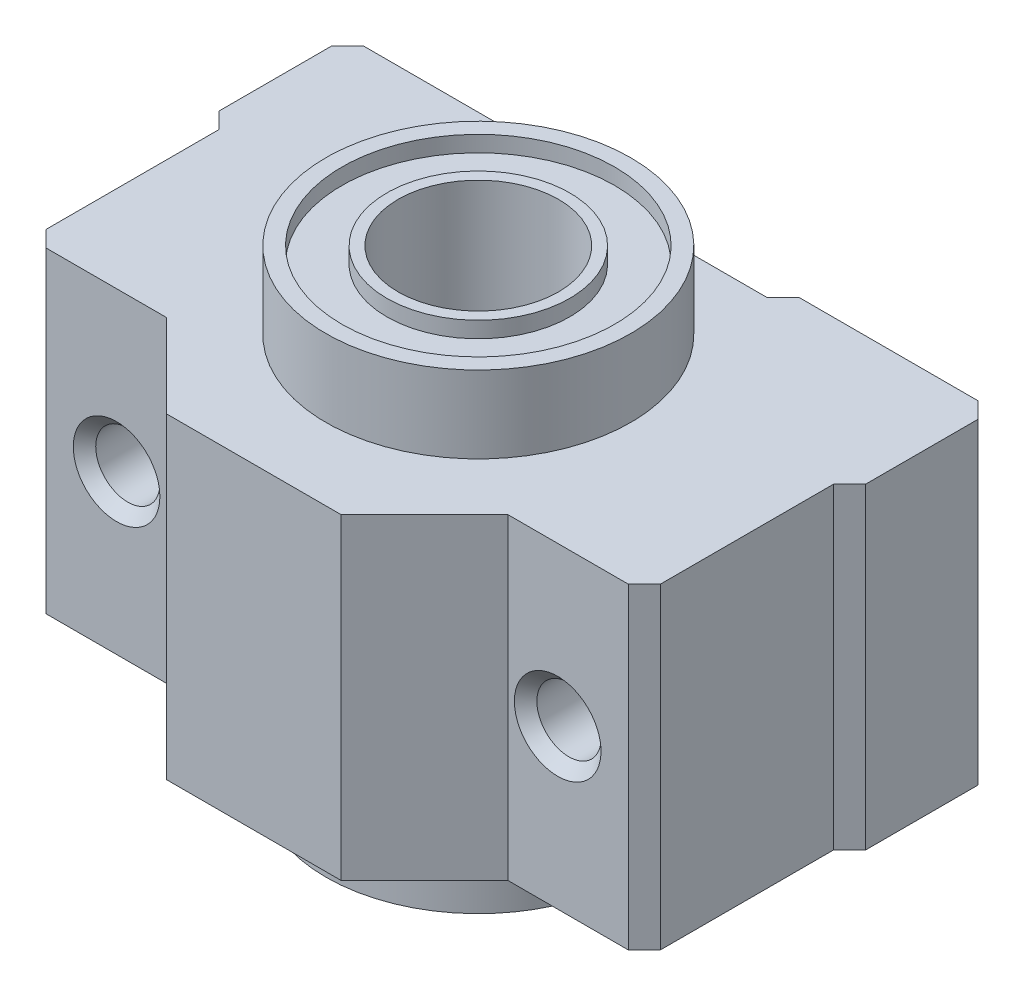
ISO-10303-21;
HEADER;
FILE_DESCRIPTION(('STEP AP214'),'2;1');
FILE_NAME('part.step','',(''),(''),'','','');
FILE_SCHEMA(('AUTOMOTIVE_DESIGN { 1 0 10303 214 1 1 1 1 }'));
ENDSEC;
DATA;
#1=APPLICATION_CONTEXT('core data for automotive mechanical design processes');
#2=APPLICATION_PROTOCOL_DEFINITION('international standard','automotive_design',2000,#1);
#3=PRODUCT_CONTEXT('',#1,'mechanical');
#4=PRODUCT('Part','Part','',(#3));
#5=PRODUCT_RELATED_PRODUCT_CATEGORY('part','',(#4));
#6=PRODUCT_DEFINITION_FORMATION('','',#4);
#7=PRODUCT_DEFINITION_CONTEXT('part definition',#1,'design');
#8=PRODUCT_DEFINITION('design','',#6,#7);
#9=PRODUCT_DEFINITION_SHAPE('','',#8);
#10=(LENGTH_UNIT() NAMED_UNIT(*) SI_UNIT(.MILLI.,.METRE.));
#11=(NAMED_UNIT(*) PLANE_ANGLE_UNIT() SI_UNIT($,.RADIAN.));
#12=(NAMED_UNIT(*) SI_UNIT($,.STERADIAN.) SOLID_ANGLE_UNIT());
#13=UNCERTAINTY_MEASURE_WITH_UNIT(LENGTH_MEASURE(1.E-05),#10,'distance_accuracy_value','');
#14=(GEOMETRIC_REPRESENTATION_CONTEXT(3) GLOBAL_UNCERTAINTY_ASSIGNED_CONTEXT((#13)) GLOBAL_UNIT_ASSIGNED_CONTEXT((#10,
#11,#12)) REPRESENTATION_CONTEXT('',''));
#15=CARTESIAN_POINT('',(0.,0.,0.));
#16=DIRECTION('',(0.,0.,1.));
#17=DIRECTION('',(1.,0.,0.));
#18=AXIS2_PLACEMENT_3D('',#15,#16,#17);
#19=CARTESIAN_POINT('',(1.11022302462516E-13,-14.6750000000002,12.));
#20=DIRECTION('',(0.,-1.,0.));
#21=DIRECTION('',(0.,0.,-1.));
#22=AXIS2_PLACEMENT_3D('',#19,#20,#21);
#23=PLANE('',#22);
#24=CARTESIAN_POINT('',(1.11022302462516E-13,-14.6750000000002,12.));
#25=DIRECTION('',(0.,-1.,0.));
#26=DIRECTION('',(0.,0.,-1.));
#27=AXIS2_PLACEMENT_3D('',#24,#25,#26);
#28=CIRCLE('',#27,5.);
#29=CARTESIAN_POINT('',(1.14214193658313E-13,-14.6750000000002,6.99999999999998));
#30=VERTEX_POINT('',#29);
#31=EDGE_CURVE('E282',#30,#30,#28,.T.);
#32=ORIENTED_EDGE('',*,*,#31,.F.);
#33=EDGE_LOOP('',(#32));
#34=FACE_BOUND('',#33,.T.);
#35=CARTESIAN_POINT('',(1.11022302462516E-13,-14.6750000000002,12.));
#36=DIRECTION('',(0.,1.,0.));
#37=DIRECTION('',(0.,0.,1.));
#38=AXIS2_PLACEMENT_3D('',#35,#36,#37);
#39=CIRCLE('',#38,5.7);
#40=CARTESIAN_POINT('',(1.07383546499307E-13,-14.6750000000002,17.7));
#41=VERTEX_POINT('',#40);
#42=EDGE_CURVE('E436',#41,#41,#39,.T.);
#43=ORIENTED_EDGE('',*,*,#42,.F.);
#44=EDGE_LOOP('',(#43));
#45=FACE_BOUND('',#44,.T.);
#46=ADVANCED_FACE('F40',(#34,#45),#23,.T.);
#47=CARTESIAN_POINT('',(0.,14.6749999999999,12.0000000000001));
#48=DIRECTION('',(0.,1.,0.));
#49=DIRECTION('',(0.,0.,-1.));
#50=AXIS2_PLACEMENT_3D('',#47,#48,#49);
#51=PLANE('',#50);
#52=CARTESIAN_POINT('',(0.,14.6749999999999,12.0000000000001));
#53=DIRECTION('',(0.,1.,0.));
#54=DIRECTION('',(0.,0.,1.));
#55=AXIS2_PLACEMENT_3D('',#52,#53,#54);
#56=CIRCLE('',#55,5.);
#57=CARTESIAN_POINT('',(0.,14.6749999999999,17.0000000000001));
#58=VERTEX_POINT('',#57);
#59=EDGE_CURVE('E278',#58,#58,#56,.T.);
#60=ORIENTED_EDGE('',*,*,#59,.F.);
#61=EDGE_LOOP('',(#60));
#62=FACE_BOUND('',#61,.T.);
#63=CARTESIAN_POINT('',(0.,14.6749999999999,12.0000000000001));
#64=DIRECTION('',(0.,1.,0.));
#65=DIRECTION('',(0.,0.,1.));
#66=AXIS2_PLACEMENT_3D('',#63,#64,#65);
#67=CIRCLE('',#66,5.7);
#68=CARTESIAN_POINT('',(0.,14.6749999999999,17.7000000000001));
#69=VERTEX_POINT('',#68);
#70=EDGE_CURVE('E426',#69,#69,#67,.T.);
#71=ORIENTED_EDGE('',*,*,#70,.T.);
#72=EDGE_LOOP('',(#71));
#73=FACE_BOUND('',#72,.T.);
#74=ADVANCED_FACE('F384',(#62,#73),#51,.T.);
#75=CARTESIAN_POINT('',(-20.1499999999999,9.8750000000003,26.0000000000002));
#76=DIRECTION('',(0.,-1.,0.));
#77=DIRECTION('',(0.,0.,-1.));
#78=AXIS2_PLACEMENT_3D('',#75,#76,#77);
#79=PLANE('',#78);
#80=CARTESIAN_POINT('',(2.4980018054066E-13,9.87499999999963,12.0000000000002));
#81=DIRECTION('',(0.,-1.,0.));
#82=DIRECTION('',(0.,0.,-1.));
#83=AXIS2_PLACEMENT_3D('',#80,#81,#82);
#84=CIRCLE('',#83,9.5);
#85=CARTESIAN_POINT('',(2.55864773812675E-13,9.87499999999965,2.50000000000022));
#86=VERTEX_POINT('',#85);
#87=EDGE_CURVE('E281',#86,#86,#84,.T.);
#88=ORIENTED_EDGE('',*,*,#87,.T.);
#89=EDGE_LOOP('',(#88));
#90=FACE_BOUND('',#89,.T.);
#91=DIRECTION('',(0.,0.,1.));
#92=VECTOR('',#91,1.);
#93=CARTESIAN_POINT('',(-19.1499999999996,9.87500000000069,2.20377644084835E-13));
#94=LINE('',#93,#92);
#95=CARTESIAN_POINT('',(-19.1499999999999,9.87500000000025,9.00000000000001));
#96=VERTEX_POINT('',#95);
#97=CARTESIAN_POINT('',(-19.1499999999996,9.87500000000019,19.8000000000001));
#98=VERTEX_POINT('',#97);
#99=EDGE_CURVE('E226',#96,#98,#94,.T.);
#100=ORIENTED_EDGE('',*,*,#99,.T.);
#101=DIRECTION('',(-0.707106781186551,0.,-0.707106781186546));
#102=VECTOR('',#101,1.);
#103=CARTESIAN_POINT('',(-19.1499999999996,9.87500000000019,19.8000000000001));
#104=LINE('',#103,#102);
#105=CARTESIAN_POINT('',(-18.1500000000001,9.87500000000019,20.8000000000001));
#106=VERTEX_POINT('',#105);
#107=EDGE_CURVE('E299',#98,#106,#104,.F.);
#108=ORIENTED_EDGE('',*,*,#107,.T.);
#109=DIRECTION('',(1.,0.,0.));
#110=VECTOR('',#109,1.);
#111=CARTESIAN_POINT('',(3.05311331771918E-13,9.87499999999969,20.8000000000001));
#112=LINE('',#111,#110);
#113=CARTESIAN_POINT('',(-10.6499999999998,9.87499999999986,20.8000000000002));
#114=VERTEX_POINT('',#113);
#115=EDGE_CURVE('E224',#106,#114,#112,.T.);
#116=ORIENTED_EDGE('',*,*,#115,.T.);
#117=DIRECTION('',(0.707106781186547,0.,0.707106781186551));
#118=VECTOR('',#117,1.);
#119=CARTESIAN_POINT('',(-15.7249999999995,9.87500000000002,15.7249999999999));
#120=LINE('',#119,#118);
#121=CARTESIAN_POINT('',(-5.45000000000007,9.87500000000008,26.0000000000002));
#122=VERTEX_POINT('',#121);
#123=EDGE_CURVE('E222',#114,#122,#120,.T.);
#124=ORIENTED_EDGE('',*,*,#123,.T.);
#125=DIRECTION('',(-1.,0.,0.));
#126=VECTOR('',#125,1.);
#127=CARTESIAN_POINT('',(-20.1499999999999,9.8750000000003,26.0000000000002));
#128=LINE('',#127,#126);
#129=CARTESIAN_POINT('',(5.45000000000001,9.87500000000036,26.));
#130=VERTEX_POINT('',#129);
#131=EDGE_CURVE('E204',#130,#122,#128,.T.);
#132=ORIENTED_EDGE('',*,*,#131,.F.);
#133=DIRECTION('',(-0.707106781186548,0.,0.70710678118655));
#134=VECTOR('',#133,1.);
#135=CARTESIAN_POINT('',(15.7250000000003,9.87500000000019,15.725));
#136=LINE('',#135,#134);
#137=CARTESIAN_POINT('',(10.6500000000001,9.87499999999969,20.8));
#138=VERTEX_POINT('',#137);
#139=EDGE_CURVE('E188',#138,#130,#136,.T.);
#140=ORIENTED_EDGE('',*,*,#139,.F.);
#141=DIRECTION('',(-1.,0.,0.));
#142=VECTOR('',#141,1.);
#143=CARTESIAN_POINT('',(3.05311331771918E-13,9.87499999999969,20.8000000000001));
#144=LINE('',#143,#142);
#145=CARTESIAN_POINT('',(18.1500000000003,9.87499999999997,20.8));
#146=VERTEX_POINT('',#145);
#147=EDGE_CURVE('E179',#146,#138,#144,.T.);
#148=ORIENTED_EDGE('',*,*,#147,.F.);
#149=DIRECTION('',(-0.707106781186547,0.,0.707106781186551));
#150=VECTOR('',#149,1.);
#151=CARTESIAN_POINT('',(18.1500000000003,9.87499999999997,20.8));
#152=LINE('',#151,#150);
#153=CARTESIAN_POINT('',(19.1500000000004,9.87500000000019,19.8000000000001));
#154=VERTEX_POINT('',#153);
#155=EDGE_CURVE('E295',#146,#154,#152,.F.);
#156=ORIENTED_EDGE('',*,*,#155,.T.);
#157=DIRECTION('',(0.,0.,1.));
#158=VECTOR('',#157,1.);
#159=CARTESIAN_POINT('',(19.1500000000002,9.87500000000036,0.));
#160=LINE('',#159,#158);
#161=CARTESIAN_POINT('',(19.15,9.87499999999969,8.99999999999998));
#162=VERTEX_POINT('',#161);
#163=EDGE_CURVE('E198',#162,#154,#160,.T.);
#164=ORIENTED_EDGE('',*,*,#163,.F.);
#165=DIRECTION('',(-0.707106781186549,0.,0.707106781186549));
#166=VECTOR('',#165,1.);
#167=CARTESIAN_POINT('',(20.1500000000002,9.87500000000041,8.00000000000017));
#168=LINE('',#167,#166);
#169=CARTESIAN_POINT('',(20.1500000000002,9.87500000000041,8.00000000000017));
#170=VERTEX_POINT('',#169);
#171=EDGE_CURVE('E293',#162,#170,#168,.F.);
#172=ORIENTED_EDGE('',*,*,#171,.T.);
#173=DIRECTION('',(0.,0.,-1.));
#174=VECTOR('',#173,1.);
#175=CARTESIAN_POINT('',(20.1499999999999,9.87500000000019,26.0000000000001));
#176=LINE('',#175,#174);
#177=CARTESIAN_POINT('',(20.1500000000003,9.87500000000063,1.00000000000016));
#178=VERTEX_POINT('',#177);
#179=EDGE_CURVE('E256',#170,#178,#176,.T.);
#180=ORIENTED_EDGE('',*,*,#179,.T.);
#181=DIRECTION('',(-0.707106781186548,0.,-0.707106781186548));
#182=VECTOR('',#181,1.);
#183=CARTESIAN_POINT('',(20.1500000000003,9.87500000000063,1.00000000000016));
#184=LINE('',#183,#182);
#185=CARTESIAN_POINT('',(19.1500000000002,9.87500000000036,0.));
#186=VERTEX_POINT('',#185);
#187=EDGE_CURVE('E289',#178,#186,#184,.T.);
#188=ORIENTED_EDGE('',*,*,#187,.T.);
#189=DIRECTION('',(-1.,0.,0.));
#190=VECTOR('',#189,1.);
#191=CARTESIAN_POINT('',(-20.1499999999997,9.87500000000025,1.09402775467365E-13));
#192=LINE('',#191,#190);
#193=CARTESIAN_POINT('',(8.00000000000015,9.87500000000008,1.91117737954882E-13));
#194=VERTEX_POINT('',#193);
#195=EDGE_CURVE('E245',#186,#194,#192,.T.);
#196=ORIENTED_EDGE('',*,*,#195,.T.);
#197=DIRECTION('',(-0.707106781186549,0.,0.707106781186549));
#198=VECTOR('',#197,1.);
#199=CARTESIAN_POINT('',(7.00000000000023,9.8750000000003,1.00000000000011));
#200=LINE('',#199,#198);
#201=CARTESIAN_POINT('',(7.00000000000023,9.8750000000003,1.00000000000011));
#202=VERTEX_POINT('',#201);
#203=EDGE_CURVE('E287',#194,#202,#200,.T.);
#204=ORIENTED_EDGE('',*,*,#203,.T.);
#205=DIRECTION('',(1.,0.,0.));
#206=VECTOR('',#205,1.);
#207=CARTESIAN_POINT('',(4.9960036108132E-13,9.87500000000036,1.00000000000016));
#208=LINE('',#207,#206);
#209=CARTESIAN_POINT('',(-6.99999999999967,9.87499999999991,1.00000000000019));
#210=VERTEX_POINT('',#209);
#211=EDGE_CURVE('E213',#210,#202,#208,.T.);
#212=ORIENTED_EDGE('',*,*,#211,.F.);
#213=DIRECTION('',(0.707106781186546,0.,0.707106781186551));
#214=VECTOR('',#213,1.);
#215=CARTESIAN_POINT('',(-7.99999999999976,9.8750000000003,1.0873192537314E-13));
#216=LINE('',#215,#214);
#217=CARTESIAN_POINT('',(-7.99999999999976,9.8750000000003,1.0873192537314E-13));
#218=VERTEX_POINT('',#217);
#219=EDGE_CURVE('E285',#210,#218,#216,.F.);
#220=ORIENTED_EDGE('',*,*,#219,.T.);
#221=CARTESIAN_POINT('',(-19.1499999999996,9.87500000000069,2.20377644084835E-13));
#222=VERTEX_POINT('',#221);
#223=EDGE_CURVE('E236',#218,#222,#192,.T.);
#224=ORIENTED_EDGE('',*,*,#223,.T.);
#225=DIRECTION('',(-0.707106781186549,0.,0.707106781186549));
#226=VECTOR('',#225,1.);
#227=CARTESIAN_POINT('',(-20.1499999999998,9.87499999999991,1.00000000000011));
#228=LINE('',#227,#226);
#229=CARTESIAN_POINT('',(-20.1499999999998,9.87499999999991,1.00000000000011));
#230=VERTEX_POINT('',#229);
#231=EDGE_CURVE('E291',#222,#230,#228,.T.);
#232=ORIENTED_EDGE('',*,*,#231,.T.);
#233=DIRECTION('',(0.,0.,-1.));
#234=VECTOR('',#233,1.);
#235=CARTESIAN_POINT('',(-20.1499999999999,9.8750000000003,26.0000000000002));
#236=LINE('',#235,#234);
#237=CARTESIAN_POINT('',(-20.1500000000001,9.87500000000013,8.00000000000012));
#238=VERTEX_POINT('',#237);
#239=EDGE_CURVE('E253',#238,#230,#236,.T.);
#240=ORIENTED_EDGE('',*,*,#239,.F.);
#241=DIRECTION('',(0.707106781186548,0.,0.707106781186549));
#242=VECTOR('',#241,1.);
#243=CARTESIAN_POINT('',(-20.1500000000001,9.87500000000013,8.00000000000012));
#244=LINE('',#243,#242);
#245=EDGE_CURVE('E297',#238,#96,#244,.T.);
#246=ORIENTED_EDGE('',*,*,#245,.T.);
#247=EDGE_LOOP('',(#100,#108,#116,#124,#132,#140,#148,#156,#164,#172,#180,#188,#196,#204,#212,
#220,#224,#232,#240,#246));
#248=FACE_BOUND('',#247,.T.);
#249=ADVANCED_FACE('F202',(#90,#248),#79,.F.);
#250=CARTESIAN_POINT('',(-20.1500000000001,-9.87500000000013,26.0000000000002));
#251=DIRECTION('',(0.,1.,0.));
#252=DIRECTION('',(0.,0.,1.));
#253=AXIS2_PLACEMENT_3D('',#250,#251,#252);
#254=PLANE('',#253);
#255=CARTESIAN_POINT('',(0.,-9.87500000000047,12.0000000000001));
#256=DIRECTION('',(0.,1.,0.));
#257=DIRECTION('',(0.,0.,1.));
#258=AXIS2_PLACEMENT_3D('',#255,#256,#257);
#259=CIRCLE('',#258,9.5);
#260=CARTESIAN_POINT('',(0.,-9.87500000000048,21.5000000000001));
#261=VERTEX_POINT('',#260);
#262=EDGE_CURVE('E274',#261,#261,#259,.F.);
#263=ORIENTED_EDGE('',*,*,#262,.F.);
#264=EDGE_LOOP('',(#263));
#265=FACE_BOUND('',#264,.T.);
#266=DIRECTION('',(1.,0.,0.));
#267=VECTOR('',#266,1.);
#268=CARTESIAN_POINT('',(-20.1499999999996,-9.87500000000002,20.8000000000001));
#269=LINE('',#268,#267);
#270=CARTESIAN_POINT('',(-18.1499999999995,-9.87500000000008,20.8000000000001));
#271=VERTEX_POINT('',#270);
#272=CARTESIAN_POINT('',(-10.6499999999999,-9.87500000000013,20.8000000000001));
#273=VERTEX_POINT('',#272);
#274=EDGE_CURVE('E262',#271,#273,#269,.T.);
#275=ORIENTED_EDGE('',*,*,#274,.F.);
#276=DIRECTION('',(0.707106781186551,0.,0.707106781186546));
#277=VECTOR('',#276,1.);
#278=CARTESIAN_POINT('',(-19.1499999999996,-9.87499999999997,19.8000000000001));
#279=LINE('',#278,#277);
#280=CARTESIAN_POINT('',(-19.1499999999996,-9.87499999999997,19.8000000000001));
#281=VERTEX_POINT('',#280);
#282=EDGE_CURVE('E316',#271,#281,#279,.F.);
#283=ORIENTED_EDGE('',*,*,#282,.T.);
#284=DIRECTION('',(0.,0.,1.));
#285=VECTOR('',#284,1.);
#286=CARTESIAN_POINT('',(-19.1499999999999,-9.87499999999991,26.0000000000001));
#287=LINE('',#286,#285);
#288=CARTESIAN_POINT('',(-19.1499999999996,-9.87499999999974,9.00000000000018));
#289=VERTEX_POINT('',#288);
#290=EDGE_CURVE('E264',#289,#281,#287,.T.);
#291=ORIENTED_EDGE('',*,*,#290,.F.);
#292=DIRECTION('',(-0.707106781186548,0.,-0.707106781186549));
#293=VECTOR('',#292,1.);
#294=CARTESIAN_POINT('',(-20.1499999999995,-9.8749999999998,8.00000000000004));
#295=LINE('',#294,#293);
#296=CARTESIAN_POINT('',(-20.1499999999995,-9.8749999999998,8.00000000000004));
#297=VERTEX_POINT('',#296);
#298=EDGE_CURVE('E314',#289,#297,#295,.T.);
#299=ORIENTED_EDGE('',*,*,#298,.T.);
#300=DIRECTION('',(0.,0.,-1.));
#301=VECTOR('',#300,1.);
#302=CARTESIAN_POINT('',(-20.1500000000001,-9.87500000000013,26.0000000000002));
#303=LINE('',#302,#301);
#304=CARTESIAN_POINT('',(-20.1500000000001,-9.87499999999997,1.00000000000025));
#305=VERTEX_POINT('',#304);
#306=EDGE_CURVE('E250',#297,#305,#303,.T.);
#307=ORIENTED_EDGE('',*,*,#306,.T.);
#308=DIRECTION('',(0.707106781186549,0.,-0.707106781186549));
#309=VECTOR('',#308,1.);
#310=CARTESIAN_POINT('',(-20.1500000000001,-9.87499999999997,1.00000000000025));
#311=LINE('',#310,#309);
#312=CARTESIAN_POINT('',(-19.1499999999998,-9.87499999999947,0.));
#313=VERTEX_POINT('',#312);
#314=EDGE_CURVE('E308',#305,#313,#311,.T.);
#315=ORIENTED_EDGE('',*,*,#314,.T.);
#316=DIRECTION('',(1.,0.,0.));
#317=VECTOR('',#316,1.);
#318=CARTESIAN_POINT('',(-20.1499999999999,-9.87499999999991,1.42647124581202E-13));
#319=LINE('',#318,#317);
#320=CARTESIAN_POINT('',(-8.00000000000001,-9.87499999999997,0.));
#321=VERTEX_POINT('',#320);
#322=EDGE_CURVE('E239',#313,#321,#319,.T.);
#323=ORIENTED_EDGE('',*,*,#322,.T.);
#324=DIRECTION('',(-0.707106781186546,0.,-0.707106781186551));
#325=VECTOR('',#324,1.);
#326=CARTESIAN_POINT('',(-8.00000000000001,-9.87499999999997,0.));
#327=LINE('',#326,#325);
#328=CARTESIAN_POINT('',(-6.99999999999978,-9.87500000000008,1.));
#329=VERTEX_POINT('',#328);
#330=EDGE_CURVE('E303',#321,#329,#327,.F.);
#331=ORIENTED_EDGE('',*,*,#330,.T.);
#332=DIRECTION('',(1.,0.,0.));
#333=VECTOR('',#332,1.);
#334=CARTESIAN_POINT('',(-20.1500000000001,-9.87500000000008,1.00000000000014));
#335=LINE('',#334,#333);
#336=CARTESIAN_POINT('',(7.00000000000001,-9.87499999999997,0.999999999999948));
#337=VERTEX_POINT('',#336);
#338=EDGE_CURVE('E267',#329,#337,#335,.T.);
#339=ORIENTED_EDGE('',*,*,#338,.T.);
#340=DIRECTION('',(0.707106781186549,0.,-0.707106781186549));
#341=VECTOR('',#340,1.);
#342=CARTESIAN_POINT('',(7.00000000000001,-9.87499999999997,0.999999999999948));
#343=LINE('',#342,#341);
#344=CARTESIAN_POINT('',(8.00000000000034,-9.87499999999986,-1.6423630034082E-13));
#345=VERTEX_POINT('',#344);
#346=EDGE_CURVE('E62',#337,#345,#343,.T.);
#347=ORIENTED_EDGE('',*,*,#346,.T.);
#348=CARTESIAN_POINT('',(19.1500000000001,-9.87499999999991,0.));
#349=VERTEX_POINT('',#348);
#350=EDGE_CURVE('E246',#345,#349,#319,.T.);
#351=ORIENTED_EDGE('',*,*,#350,.T.);
#352=DIRECTION('',(0.707106781186548,0.,0.707106781186548));
#353=VECTOR('',#352,1.);
#354=CARTESIAN_POINT('',(20.1500000000004,-9.87499999999913,0.999999999999892));
#355=LINE('',#354,#353);
#356=CARTESIAN_POINT('',(20.1500000000004,-9.87499999999913,0.999999999999892));
#357=VERTEX_POINT('',#356);
#358=EDGE_CURVE('E306',#349,#357,#355,.T.);
#359=ORIENTED_EDGE('',*,*,#358,.T.);
#360=DIRECTION('',(0.,0.,-1.));
#361=VECTOR('',#360,1.);
#362=CARTESIAN_POINT('',(20.15,-9.87499999999958,26.));
#363=LINE('',#362,#361);
#364=CARTESIAN_POINT('',(20.1500000000005,-9.87499999999947,8.00000000000017));
#365=VERTEX_POINT('',#364);
#366=EDGE_CURVE('E242',#365,#357,#363,.T.);
#367=ORIENTED_EDGE('',*,*,#366,.F.);
#368=DIRECTION('',(0.707106781186549,0.,-0.707106781186549));
#369=VECTOR('',#368,1.);
#370=CARTESIAN_POINT('',(20.1500000000005,-9.87499999999947,8.00000000000017));
#371=LINE('',#370,#369);
#372=CARTESIAN_POINT('',(19.1500000000004,-9.87499999999986,9.00000000000007));
#373=VERTEX_POINT('',#372);
#374=EDGE_CURVE('E310',#365,#373,#371,.F.);
#375=ORIENTED_EDGE('',*,*,#374,.T.);
#376=DIRECTION('',(0.,0.,1.));
#377=VECTOR('',#376,1.);
#378=CARTESIAN_POINT('',(19.15,-9.87499999999974,26.0000000000002));
#379=LINE('',#378,#377);
#380=CARTESIAN_POINT('',(19.1500000000002,-9.87499999999974,19.8000000000002));
#381=VERTEX_POINT('',#380);
#382=EDGE_CURVE('E271',#373,#381,#379,.T.);
#383=ORIENTED_EDGE('',*,*,#382,.T.);
#384=DIRECTION('',(0.707106781186547,0.,-0.707106781186551));
#385=VECTOR('',#384,1.);
#386=CARTESIAN_POINT('',(18.1500000000003,-9.87500000000041,20.8000000000001));
#387=LINE('',#386,#385);
#388=CARTESIAN_POINT('',(18.1500000000003,-9.87500000000041,20.8000000000001));
#389=VERTEX_POINT('',#388);
#390=EDGE_CURVE('E312',#381,#389,#387,.F.);
#391=ORIENTED_EDGE('',*,*,#390,.T.);
#392=DIRECTION('',(-1.,0.,0.));
#393=VECTOR('',#392,1.);
#394=CARTESIAN_POINT('',(-20.1499999999996,-9.87499999999991,20.8000000000002));
#395=LINE('',#394,#393);
#396=CARTESIAN_POINT('',(10.6499999999999,-9.87500000000025,20.8));
#397=VERTEX_POINT('',#396);
#398=EDGE_CURVE('E269',#389,#397,#395,.T.);
#399=ORIENTED_EDGE('',*,*,#398,.T.);
#400=DIRECTION('',(-0.707106781186547,0.,0.70710678118655));
#401=VECTOR('',#400,1.);
#402=CARTESIAN_POINT('',(-7.3499999999995,-9.87500000000052,38.8000000000001));
#403=LINE('',#402,#401);
#404=CARTESIAN_POINT('',(5.4499999999999,-9.87500000000002,26.));
#405=VERTEX_POINT('',#404);
#406=EDGE_CURVE('E196',#397,#405,#403,.T.);
#407=ORIENTED_EDGE('',*,*,#406,.T.);
#408=DIRECTION('',(1.,0.,0.));
#409=VECTOR('',#408,1.);
#410=CARTESIAN_POINT('',(-20.1500000000001,-9.87500000000013,26.0000000000002));
#411=LINE('',#410,#409);
#412=CARTESIAN_POINT('',(-5.44999999999995,-9.87499999999963,26.));
#413=VERTEX_POINT('',#412);
#414=EDGE_CURVE('E238',#413,#405,#411,.T.);
#415=ORIENTED_EDGE('',*,*,#414,.F.);
#416=DIRECTION('',(0.707106781186547,0.,0.707106781186551));
#417=VECTOR('',#416,1.);
#418=CARTESIAN_POINT('',(-12.7999999999996,-9.87500000000008,18.6500000000001));
#419=LINE('',#418,#417);
#420=EDGE_CURVE('E232',#273,#413,#419,.T.);
#421=ORIENTED_EDGE('',*,*,#420,.F.);
#422=EDGE_LOOP('',(#275,#283,#291,#299,#307,#315,#323,#331,#339,#347,#351,#359,#367,#375,#383,
#391,#399,#407,#415,#421));
#423=FACE_BOUND('',#422,.T.);
#424=ADVANCED_FACE('F486',(#265,#423),#254,.F.);
#425=CARTESIAN_POINT('',(0.,0.,0.));
#426=DIRECTION('',(0.,0.,-1.));
#427=DIRECTION('',(-1.,0.,0.));
#428=AXIS2_PLACEMENT_3D('',#425,#426,#427);
#429=PLANE('',#428);
#430=CARTESIAN_POINT('',(-13.7499999999997,2.22044604925031E-13,1.11788020246834E-13));
#431=DIRECTION('',(0.,0.,-1.));
#432=DIRECTION('',(-1.,0.,0.));
#433=AXIS2_PLACEMENT_3D('',#430,#431,#432);
#434=CIRCLE('',#433,2.70000000000005);
#435=CARTESIAN_POINT('',(-16.4499999999998,2.21557494572977E-13,1.12987061113429E-13));
#436=VERTEX_POINT('',#435);
#437=EDGE_CURVE('E11',#436,#436,#434,.F.);
#438=ORIENTED_EDGE('',*,*,#437,.T.);
#439=EDGE_LOOP('',(#438));
#440=FACE_BOUND('',#439,.T.);
#441=ORIENTED_EDGE('',*,*,#322,.F.);
#442=DIRECTION('',(0.,1.,0.));
#443=VECTOR('',#442,1.);
#444=CARTESIAN_POINT('',(-19.1499999999996,9.87500000000069,2.20377644084835E-13));
#445=LINE('',#444,#443);
#446=EDGE_CURVE('E336',#313,#222,#445,.T.);
#447=ORIENTED_EDGE('',*,*,#446,.T.);
#448=ORIENTED_EDGE('',*,*,#223,.F.);
#449=DIRECTION('',(0.,-1.,0.));
#450=VECTOR('',#449,1.);
#451=CARTESIAN_POINT('',(-7.99999999999984,-3.33066907387547E-13,1.11469535858666E-13));
#452=LINE('',#451,#450);
#453=EDGE_CURVE('E333',#218,#321,#452,.T.);
#454=ORIENTED_EDGE('',*,*,#453,.T.);
#455=EDGE_LOOP('',(#441,#447,#448,#454));
#456=FACE_BOUND('',#455,.T.);
#457=ADVANCED_FACE('F491',(#440,#456),#429,.T.);
#458=CARTESIAN_POINT('',(-20.1500000000001,-9.87500000000013,26.0000000000002));
#459=DIRECTION('',(1.,0.,0.));
#460=DIRECTION('',(0.,0.,-1.));
#461=AXIS2_PLACEMENT_3D('',#458,#459,#460);
#462=PLANE('',#461);
#463=ORIENTED_EDGE('',*,*,#306,.F.);
#464=DIRECTION('',(0.,1.,0.));
#465=VECTOR('',#464,1.);
#466=CARTESIAN_POINT('',(-20.1500000000001,9.87500000000013,8.00000000000012));
#467=LINE('',#466,#465);
#468=EDGE_CURVE('E321',#297,#238,#467,.T.);
#469=ORIENTED_EDGE('',*,*,#468,.T.);
#470=ORIENTED_EDGE('',*,*,#239,.T.);
#471=DIRECTION('',(0.,-1.,0.));
#472=VECTOR('',#471,1.);
#473=CARTESIAN_POINT('',(-20.1500000000001,-9.87499999999997,1.00000000000025));
#474=LINE('',#473,#472);
#475=EDGE_CURVE('E318',#230,#305,#474,.T.);
#476=ORIENTED_EDGE('',*,*,#475,.T.);
#477=EDGE_LOOP('',(#463,#469,#470,#476));
#478=FACE_BOUND('',#477,.T.);
#479=ADVANCED_FACE('F496',(#478),#462,.F.);
#480=CARTESIAN_POINT('',(1.66533453693773E-13,-1.66533453693773E-13,26.0000000000002));
#481=DIRECTION('',(0.,0.,-1.));
#482=DIRECTION('',(-1.,0.,0.));
#483=AXIS2_PLACEMENT_3D('',#480,#481,#482);
#484=PLANE('',#483);
#485=ORIENTED_EDGE('',*,*,#414,.T.);
#486=DIRECTION('',(0.,1.,0.));
#487=VECTOR('',#486,1.);
#488=CARTESIAN_POINT('',(5.45000000000009,-10.1249999999998,26.0000000000002));
#489=LINE('',#488,#487);
#490=EDGE_CURVE('E197',#405,#130,#489,.T.);
#491=ORIENTED_EDGE('',*,*,#490,.T.);
#492=ORIENTED_EDGE('',*,*,#131,.T.);
#493=DIRECTION('',(0.,1.,0.));
#494=VECTOR('',#493,1.);
#495=CARTESIAN_POINT('',(-5.44999999999984,2.77555756156289E-13,26.0000000000002));
#496=LINE('',#495,#494);
#497=EDGE_CURVE('E259',#413,#122,#496,.T.);
#498=ORIENTED_EDGE('',*,*,#497,.F.);
#499=EDGE_LOOP('',(#485,#491,#492,#498));
#500=FACE_BOUND('',#499,.T.);
#501=ADVANCED_FACE('F501',(#500),#484,.F.);
#502=CARTESIAN_POINT('',(20.15,-9.87499999999958,26.));
#503=DIRECTION('',(-1.,0.,0.));
#504=DIRECTION('',(0.,0.,1.));
#505=AXIS2_PLACEMENT_3D('',#502,#503,#504);
#506=PLANE('',#505);
#507=ORIENTED_EDGE('',*,*,#179,.F.);
#508=DIRECTION('',(0.,-1.,0.));
#509=VECTOR('',#508,1.);
#510=CARTESIAN_POINT('',(20.1500000000005,-9.87499999999947,8.00000000000017));
#511=LINE('',#510,#509);
#512=EDGE_CURVE('E330',#170,#365,#511,.T.);
#513=ORIENTED_EDGE('',*,*,#512,.T.);
#514=ORIENTED_EDGE('',*,*,#366,.T.);
#515=DIRECTION('',(0.,1.,0.));
#516=VECTOR('',#515,1.);
#517=CARTESIAN_POINT('',(20.1500000000003,9.87500000000063,1.00000000000016));
#518=LINE('',#517,#516);
#519=EDGE_CURVE('E327',#357,#178,#518,.T.);
#520=ORIENTED_EDGE('',*,*,#519,.T.);
#521=EDGE_LOOP('',(#507,#513,#514,#520));
#522=FACE_BOUND('',#521,.T.);
#523=ADVANCED_FACE('F497',(#522),#506,.F.);
#524=CARTESIAN_POINT('',(13.7500000000002,2.77555756156289E-13,1.93523311525085E-13));
#525=DIRECTION('',(0.,0.,-1.));
#526=DIRECTION('',(-1.,0.,0.));
#527=AXIS2_PLACEMENT_3D('',#524,#525,#526);
#528=CIRCLE('',#527,2.70000000000005);
#529=CARTESIAN_POINT('',(11.0500000000001,2.77068645804235E-13,1.9472235239168E-13));
#530=VERTEX_POINT('',#529);
#531=EDGE_CURVE('E350',#530,#530,#528,.F.);
#532=ORIENTED_EDGE('',*,*,#531,.T.);
#533=EDGE_LOOP('',(#532));
#534=FACE_BOUND('',#533,.T.);
#535=ORIENTED_EDGE('',*,*,#195,.F.);
#536=DIRECTION('',(0.,-1.,0.));
#537=VECTOR('',#536,1.);
#538=CARTESIAN_POINT('',(19.1500000000001,-9.87499999999991,0.));
#539=LINE('',#538,#537);
#540=EDGE_CURVE('E55',#186,#349,#539,.T.);
#541=ORIENTED_EDGE('',*,*,#540,.T.);
#542=ORIENTED_EDGE('',*,*,#350,.F.);
#543=DIRECTION('',(0.,1.,0.));
#544=VECTOR('',#543,1.);
#545=CARTESIAN_POINT('',(8.00000000000015,9.87500000000008,1.91117737954882E-13));
#546=LINE('',#545,#544);
#547=EDGE_CURVE('E338',#345,#194,#546,.T.);
#548=ORIENTED_EDGE('',*,*,#547,.T.);
#549=EDGE_LOOP('',(#535,#541,#542,#548));
#550=FACE_BOUND('',#549,.T.);
#551=ADVANCED_FACE('F500',(#534,#550),#429,.T.);
#552=CARTESIAN_POINT('',(-19.1499999999999,-10.1249999999997,1.70423028987565E-13));
#553=DIRECTION('',(-1.,0.,0.));
#554=DIRECTION('',(0.,0.,1.));
#555=AXIS2_PLACEMENT_3D('',#552,#553,#554);
#556=PLANE('',#555);
#557=ORIENTED_EDGE('',*,*,#290,.T.);
#558=DIRECTION('',(0.,1.,0.));
#559=VECTOR('',#558,1.);
#560=CARTESIAN_POINT('',(-19.1499999999997,-10.1249999999999,19.8));
#561=LINE('',#560,#559);
#562=EDGE_CURVE('E277',#281,#98,#561,.T.);
#563=ORIENTED_EDGE('',*,*,#562,.T.);
#564=ORIENTED_EDGE('',*,*,#99,.F.);
#565=DIRECTION('',(0.,1.,0.));
#566=VECTOR('',#565,1.);
#567=CARTESIAN_POINT('',(-19.1499999999997,-10.1249999999996,9.00000000000007));
#568=LINE('',#567,#566);
#569=EDGE_CURVE('E229',#289,#96,#568,.T.);
#570=ORIENTED_EDGE('',*,*,#569,.F.);
#571=EDGE_LOOP('',(#557,#563,#564,#570));
#572=FACE_BOUND('',#571,.T.);
#573=ADVANCED_FACE('F567',(#572),#556,.T.);
#574=CARTESIAN_POINT('',(0.,-10.125,20.8));
#575=DIRECTION('',(0.,0.,1.));
#576=DIRECTION('',(1.,0.,0.));
#577=AXIS2_PLACEMENT_3D('',#574,#575,#576);
#578=PLANE('',#577);
#579=CARTESIAN_POINT('',(-13.7499999999997,0.,20.8000000000002));
#580=DIRECTION('',(0.,0.,1.));
#581=DIRECTION('',(1.,0.,0.));
#582=AXIS2_PLACEMENT_3D('',#579,#580,#581);
#583=CIRCLE('',#582,2.70000000000003);
#584=CARTESIAN_POINT('',(-11.0499999999996,0.,20.8000000000002));
#585=VERTEX_POINT('',#584);
#586=EDGE_CURVE('E48',#585,#585,#583,.F.);
#587=ORIENTED_EDGE('',*,*,#586,.T.);
#588=EDGE_LOOP('',(#587));
#589=FACE_BOUND('',#588,.T.);
#590=ORIENTED_EDGE('',*,*,#115,.F.);
#591=DIRECTION('',(0.,-1.,0.));
#592=VECTOR('',#591,1.);
#593=CARTESIAN_POINT('',(-18.15,-10.1250000000002,20.8000000000002));
#594=LINE('',#593,#592);
#595=EDGE_CURVE('E301',#106,#271,#594,.T.);
#596=ORIENTED_EDGE('',*,*,#595,.T.);
#597=ORIENTED_EDGE('',*,*,#274,.T.);
#598=DIRECTION('',(0.,1.,0.));
#599=VECTOR('',#598,1.);
#600=CARTESIAN_POINT('',(-10.6499999999999,-10.1249999999999,20.8000000000002));
#601=LINE('',#600,#599);
#602=EDGE_CURVE('E228',#273,#114,#601,.T.);
#603=ORIENTED_EDGE('',*,*,#602,.T.);
#604=EDGE_LOOP('',(#590,#596,#597,#603));
#605=FACE_BOUND('',#604,.T.);
#606=ADVANCED_FACE('F361',(#589,#605),#578,.T.);
#607=CARTESIAN_POINT('',(-15.7249999999998,-10.1250000000001,15.7250000000001));
#608=DIRECTION('',(-0.70710678118655,0.,0.707106781186547));
#609=DIRECTION('',(0.707106781186547,0.,0.707106781186551));
#610=AXIS2_PLACEMENT_3D('',#607,#608,#609);
#611=PLANE('',#610);
#612=ORIENTED_EDGE('',*,*,#420,.T.);
#613=ORIENTED_EDGE('',*,*,#497,.T.);
#614=ORIENTED_EDGE('',*,*,#123,.F.);
#615=ORIENTED_EDGE('',*,*,#602,.F.);
#616=EDGE_LOOP('',(#612,#613,#614,#615));
#617=FACE_BOUND('',#616,.T.);
#618=ADVANCED_FACE('F565',(#617),#611,.T.);
#619=CARTESIAN_POINT('',(2.4980018054066E-13,-10.1249999999998,1.00000000000009));
#620=DIRECTION('',(0.,0.,1.));
#621=DIRECTION('',(1.,0.,0.));
#622=AXIS2_PLACEMENT_3D('',#619,#620,#621);
#623=PLANE('',#622);
#624=DIRECTION('',(0.,1.,0.));
#625=VECTOR('',#624,1.);
#626=CARTESIAN_POINT('',(-6.99999999999965,-10.1250000000002,1.00000000000017));
#627=LINE('',#626,#625);
#628=EDGE_CURVE('E216',#329,#210,#627,.T.);
#629=ORIENTED_EDGE('',*,*,#628,.T.);
#630=ORIENTED_EDGE('',*,*,#211,.T.);
#631=DIRECTION('',(0.,1.,0.));
#632=VECTOR('',#631,1.);
#633=CARTESIAN_POINT('',(7.00000000000026,-10.1249999999999,1.00000000000006));
#634=LINE('',#633,#632);
#635=EDGE_CURVE('E189',#337,#202,#634,.T.);
#636=ORIENTED_EDGE('',*,*,#635,.F.);
#637=ORIENTED_EDGE('',*,*,#338,.F.);
#638=EDGE_LOOP('',(#629,#630,#636,#637));
#639=FACE_BOUND('',#638,.T.);
#640=ADVANCED_FACE('F561',(#639),#623,.F.);
#641=CARTESIAN_POINT('',(0.,-10.1250000000002,20.8));
#642=DIRECTION('',(0.,0.,-1.));
#643=DIRECTION('',(-1.,0.,0.));
#644=AXIS2_PLACEMENT_3D('',#641,#642,#643);
#645=PLANE('',#644);
#646=CARTESIAN_POINT('',(13.7500000000007,-1.66533453693773E-13,20.8));
#647=DIRECTION('',(0.,0.,-1.));
#648=DIRECTION('',(-1.,0.,0.));
#649=AXIS2_PLACEMENT_3D('',#646,#647,#648);
#650=CIRCLE('',#649,2.69999999999998);
#651=CARTESIAN_POINT('',(11.0500000000008,-1.67170444154152E-13,20.8));
#652=VERTEX_POINT('',#651);
#653=EDGE_CURVE('E341',#652,#652,#650,.T.);
#654=ORIENTED_EDGE('',*,*,#653,.T.);
#655=EDGE_LOOP('',(#654));
#656=FACE_BOUND('',#655,.T.);
#657=ORIENTED_EDGE('',*,*,#398,.F.);
#658=DIRECTION('',(0.,1.,0.));
#659=VECTOR('',#658,1.);
#660=CARTESIAN_POINT('',(18.1500000000001,-10.1250000000001,20.8000000000001));
#661=LINE('',#660,#659);
#662=EDGE_CURVE('E185',#389,#146,#661,.T.);
#663=ORIENTED_EDGE('',*,*,#662,.T.);
#664=ORIENTED_EDGE('',*,*,#147,.T.);
#665=DIRECTION('',(0.,1.,0.));
#666=VECTOR('',#665,1.);
#667=CARTESIAN_POINT('',(10.6500000000002,-10.125,20.8000000000001));
#668=LINE('',#667,#666);
#669=EDGE_CURVE('E183',#397,#138,#668,.T.);
#670=ORIENTED_EDGE('',*,*,#669,.F.);
#671=EDGE_LOOP('',(#657,#663,#664,#670));
#672=FACE_BOUND('',#671,.T.);
#673=ADVANCED_FACE('F182',(#656,#672),#645,.F.);
#674=CARTESIAN_POINT('',(19.1500000000006,-10.125,0.));
#675=DIRECTION('',(-1.,0.,0.));
#676=DIRECTION('',(0.,0.,1.));
#677=AXIS2_PLACEMENT_3D('',#674,#675,#676);
#678=PLANE('',#677);
#679=ORIENTED_EDGE('',*,*,#163,.T.);
#680=DIRECTION('',(0.,-1.,0.));
#681=VECTOR('',#680,1.);
#682=CARTESIAN_POINT('',(19.1500000000006,-10.125,19.8000000000001));
#683=LINE('',#682,#681);
#684=EDGE_CURVE('E325',#154,#381,#683,.T.);
#685=ORIENTED_EDGE('',*,*,#684,.T.);
#686=ORIENTED_EDGE('',*,*,#382,.F.);
#687=DIRECTION('',(0.,1.,0.));
#688=VECTOR('',#687,1.);
#689=CARTESIAN_POINT('',(19.1500000000002,-10.1249999999997,9.00000000000007));
#690=LINE('',#689,#688);
#691=EDGE_CURVE('E210',#373,#162,#690,.T.);
#692=ORIENTED_EDGE('',*,*,#691,.T.);
#693=EDGE_LOOP('',(#679,#685,#686,#692));
#694=FACE_BOUND('',#693,.T.);
#695=ADVANCED_FACE('F553',(#694),#678,.F.);
#696=CARTESIAN_POINT('',(15.7250000000001,-10.1250000000001,15.7250000000002));
#697=DIRECTION('',(-0.70710678118655,0.,-0.707106781186547));
#698=DIRECTION('',(-0.707106781186547,0.,0.70710678118655));
#699=AXIS2_PLACEMENT_3D('',#696,#697,#698);
#700=PLANE('',#699);
#701=ORIENTED_EDGE('',*,*,#669,.T.);
#702=ORIENTED_EDGE('',*,*,#139,.T.);
#703=ORIENTED_EDGE('',*,*,#490,.F.);
#704=ORIENTED_EDGE('',*,*,#406,.F.);
#705=EDGE_LOOP('',(#701,#702,#703,#704));
#706=FACE_BOUND('',#705,.T.);
#707=ADVANCED_FACE('F193',(#706),#700,.F.);
#708=CARTESIAN_POINT('',(13.7500000000002,4.44089209850063E-13,26.0000000000001));
#709=DIRECTION('',(0.,0.,-1.));
#710=DIRECTION('',(-1.,0.,0.));
#711=AXIS2_PLACEMENT_3D('',#708,#709,#710);
#712=CYLINDRICAL_SURFACE('',#711,2.);
#713=CARTESIAN_POINT('',(13.7500000000001,3.33066907387547E-13,20.1000000000002));
#714=DIRECTION('',(0.,0.,-1.));
#715=DIRECTION('',(-1.,0.,0.));
#716=AXIS2_PLACEMENT_3D('',#713,#714,#715);
#717=CIRCLE('',#716,2.);
#718=CARTESIAN_POINT('',(11.7500000000001,3.32706084904544E-13,20.1000000000002));
#719=VERTEX_POINT('',#718);
#720=EDGE_CURVE('E347',#719,#719,#717,.F.);
#721=ORIENTED_EDGE('',*,*,#720,.T.);
#722=EDGE_LOOP('',(#721));
#723=FACE_BOUND('',#722,.T.);
#724=CARTESIAN_POINT('',(13.7500000000003,0.,0.700000000000089));
#725=DIRECTION('',(0.,0.,-1.));
#726=DIRECTION('',(-1.,0.,0.));
#727=AXIS2_PLACEMENT_3D('',#724,#725,#726);
#728=CIRCLE('',#727,2.);
#729=CARTESIAN_POINT('',(11.7500000000003,0.,0.70000000000009));
#730=VERTEX_POINT('',#729);
#731=EDGE_CURVE('E344',#730,#730,#728,.T.);
#732=ORIENTED_EDGE('',*,*,#731,.T.);
#733=EDGE_LOOP('',(#732));
#734=FACE_BOUND('',#733,.T.);
#735=ADVANCED_FACE('F374',(#723,#734),#712,.F.);
#736=CARTESIAN_POINT('',(-13.7499999999998,1.66533453693773E-13,26.0000000000001));
#737=DIRECTION('',(0.,0.,-1.));
#738=DIRECTION('',(-1.,0.,0.));
#739=AXIS2_PLACEMENT_3D('',#736,#737,#738);
#740=CYLINDRICAL_SURFACE('',#739,2.);
#741=CARTESIAN_POINT('',(-13.7499999999999,1.66533453693773E-13,20.1000000000001));
#742=DIRECTION('',(0.,0.,1.));
#743=DIRECTION('',(1.,0.,0.));
#744=AXIS2_PLACEMENT_3D('',#741,#742,#743);
#745=CIRCLE('',#744,2.);
#746=CARTESIAN_POINT('',(-11.7499999999999,1.66894276176776E-13,20.1000000000001));
#747=VERTEX_POINT('',#746);
#748=EDGE_CURVE('E356',#747,#747,#745,.T.);
#749=ORIENTED_EDGE('',*,*,#748,.T.);
#750=EDGE_LOOP('',(#749));
#751=FACE_BOUND('',#750,.T.);
#752=CARTESIAN_POINT('',(-13.7499999999997,4.44089209850063E-13,0.700000000000118));
#753=DIRECTION('',(0.,0.,-1.));
#754=DIRECTION('',(-1.,0.,0.));
#755=AXIS2_PLACEMENT_3D('',#752,#753,#754);
#756=CIRCLE('',#755,2.);
#757=CARTESIAN_POINT('',(-15.7499999999997,4.4372838736706E-13,0.700000000000119));
#758=VERTEX_POINT('',#757);
#759=EDGE_CURVE('E353',#758,#758,#756,.T.);
#760=ORIENTED_EDGE('',*,*,#759,.T.);
#761=EDGE_LOOP('',(#760));
#762=FACE_BOUND('',#761,.T.);
#763=ADVANCED_FACE('F370',(#751,#762),#740,.F.);
#764=CARTESIAN_POINT('',(1.11022302462516E-13,-14.6750000000002,12.));
#765=DIRECTION('',(0.,1.,0.));
#766=DIRECTION('',(0.,0.,1.));
#767=AXIS2_PLACEMENT_3D('',#764,#765,#766);
#768=CYLINDRICAL_SURFACE('',#767,9.5);
#769=CARTESIAN_POINT('',(1.11022302462516E-13,-14.6750000000002,12.));
#770=DIRECTION('',(0.,-1.,0.));
#771=DIRECTION('',(0.,0.,-1.));
#772=AXIS2_PLACEMENT_3D('',#769,#770,#771);
#773=CIRCLE('',#772,9.5);
#774=CARTESIAN_POINT('',(1.1708689573453E-13,-14.6750000000002,2.49999999999998));
#775=VERTEX_POINT('',#774);
#776=EDGE_CURVE('E217',#775,#775,#773,.T.);
#777=ORIENTED_EDGE('',*,*,#776,.F.);
#778=EDGE_LOOP('',(#777));
#779=FACE_BOUND('',#778,.T.);
#780=ORIENTED_EDGE('',*,*,#262,.T.);
#781=EDGE_LOOP('',(#780));
#782=FACE_BOUND('',#781,.T.);
#783=ADVANCED_FACE('F373',(#779,#782),#768,.T.);
#784=CARTESIAN_POINT('',(1.11022302462516E-13,-14.6750000000002,12.));
#785=DIRECTION('',(0.,1.,0.));
#786=DIRECTION('',(0.,0.,1.));
#787=AXIS2_PLACEMENT_3D('',#784,#785,#786);
#788=CIRCLE('',#787,8.5);
#789=CARTESIAN_POINT('',(1.05596087429661E-13,-14.6750000000002,20.5));
#790=VERTEX_POINT('',#789);
#791=EDGE_CURVE('E410',#790,#790,#788,.T.);
#792=ORIENTED_EDGE('',*,*,#791,.T.);
#793=EDGE_LOOP('',(#792));
#794=FACE_BOUND('',#793,.T.);
#795=ORIENTED_EDGE('',*,*,#776,.T.);
#796=EDGE_LOOP('',(#795));
#797=FACE_BOUND('',#796,.T.);
#798=ADVANCED_FACE('F387',(#794,#797),#23,.T.);
#799=CARTESIAN_POINT('',(0.,14.6749999999999,12.0000000000001));
#800=DIRECTION('',(0.,-1.,0.));
#801=DIRECTION('',(0.,0.,-1.));
#802=AXIS2_PLACEMENT_3D('',#799,#800,#801);
#803=CYLINDRICAL_SURFACE('',#802,9.5);
#804=CARTESIAN_POINT('',(0.,14.6749999999999,12.0000000000001));
#805=DIRECTION('',(0.,-1.,0.));
#806=DIRECTION('',(0.,0.,-1.));
#807=AXIS2_PLACEMENT_3D('',#804,#805,#806);
#808=CIRCLE('',#807,9.5);
#809=CARTESIAN_POINT('',(0.,14.6749999999999,2.50000000000005));
#810=VERTEX_POINT('',#809);
#811=EDGE_CURVE('E413',#810,#810,#808,.T.);
#812=ORIENTED_EDGE('',*,*,#811,.T.);
#813=EDGE_LOOP('',(#812));
#814=FACE_BOUND('',#813,.T.);
#815=ORIENTED_EDGE('',*,*,#87,.F.);
#816=EDGE_LOOP('',(#815));
#817=FACE_BOUND('',#816,.T.);
#818=ADVANCED_FACE('F399',(#814,#817),#803,.T.);
#819=CARTESIAN_POINT('',(0.,14.6749999999999,12.0000000000001));
#820=DIRECTION('',(0.,1.,0.));
#821=DIRECTION('',(0.,0.,1.));
#822=AXIS2_PLACEMENT_3D('',#819,#820,#821);
#823=CIRCLE('',#822,8.5);
#824=CARTESIAN_POINT('',(0.,14.6749999999999,20.5000000000001));
#825=VERTEX_POINT('',#824);
#826=EDGE_CURVE('E422',#825,#825,#823,.T.);
#827=ORIENTED_EDGE('',*,*,#826,.F.);
#828=EDGE_LOOP('',(#827));
#829=FACE_BOUND('',#828,.T.);
#830=ORIENTED_EDGE('',*,*,#811,.F.);
#831=EDGE_LOOP('',(#830));
#832=FACE_BOUND('',#831,.T.);
#833=ADVANCED_FACE('F393',(#829,#832),#51,.T.);
#834=CARTESIAN_POINT('',(2.77555756156289E-13,15.3249999999997,12.0000000000003));
#835=DIRECTION('',(0.,-1.,0.));
#836=DIRECTION('',(0.,0.,-1.));
#837=AXIS2_PLACEMENT_3D('',#834,#835,#836);
#838=CYLINDRICAL_SURFACE('',#837,5.);
#839=ORIENTED_EDGE('',*,*,#59,.T.);
#840=EDGE_LOOP('',(#839));
#841=FACE_BOUND('',#840,.T.);
#842=ORIENTED_EDGE('',*,*,#31,.T.);
#843=EDGE_LOOP('',(#842));
#844=FACE_BOUND('',#843,.T.);
#845=ADVANCED_FACE('F471',(#841,#844),#838,.F.);
#846=CARTESIAN_POINT('',(2.22044604925031E-13,13.6749999999995,12.0000000000002));
#847=DIRECTION('',(0.,1.,0.));
#848=DIRECTION('',(0.,0.,1.));
#849=AXIS2_PLACEMENT_3D('',#846,#847,#848);
#850=CYLINDRICAL_SURFACE('',#849,5.7);
#851=CARTESIAN_POINT('',(2.22044604925031E-13,13.6749999999995,12.0000000000002));
#852=DIRECTION('',(0.,1.,0.));
#853=DIRECTION('',(0.,0.,1.));
#854=AXIS2_PLACEMENT_3D('',#851,#852,#853);
#855=CIRCLE('',#854,5.7);
#856=CARTESIAN_POINT('',(2.18405848961823E-13,13.6749999999995,17.7000000000002));
#857=VERTEX_POINT('',#856);
#858=EDGE_CURVE('E425',#857,#857,#855,.T.);
#859=ORIENTED_EDGE('',*,*,#858,.T.);
#860=EDGE_LOOP('',(#859));
#861=FACE_BOUND('',#860,.T.);
#862=ORIENTED_EDGE('',*,*,#70,.F.);
#863=EDGE_LOOP('',(#862));
#864=FACE_BOUND('',#863,.T.);
#865=ADVANCED_FACE('F467',(#861,#864),#850,.T.);
#866=CARTESIAN_POINT('',(2.22044604925031E-13,13.6749999999995,12.0000000000002));
#867=DIRECTION('',(0.,1.,0.));
#868=DIRECTION('',(0.,0.,1.));
#869=AXIS2_PLACEMENT_3D('',#866,#867,#868);
#870=CYLINDRICAL_SURFACE('',#869,8.5);
#871=CARTESIAN_POINT('',(2.22044604925031E-13,13.6749999999995,12.0000000000002));
#872=DIRECTION('',(0.,1.,0.));
#873=DIRECTION('',(0.,0.,1.));
#874=AXIS2_PLACEMENT_3D('',#871,#872,#873);
#875=CIRCLE('',#874,8.5);
#876=CARTESIAN_POINT('',(2.16618389892176E-13,13.6749999999995,20.5000000000002));
#877=VERTEX_POINT('',#876);
#878=EDGE_CURVE('E421',#877,#877,#875,.T.);
#879=ORIENTED_EDGE('',*,*,#878,.F.);
#880=EDGE_LOOP('',(#879));
#881=FACE_BOUND('',#880,.T.);
#882=ORIENTED_EDGE('',*,*,#826,.T.);
#883=EDGE_LOOP('',(#882));
#884=FACE_BOUND('',#883,.T.);
#885=ADVANCED_FACE('F460',(#881,#884),#870,.F.);
#886=CARTESIAN_POINT('',(7.21644966006352E-13,13.675,0.));
#887=DIRECTION('',(0.,1.,0.));
#888=DIRECTION('',(0.,0.,1.));
#889=AXIS2_PLACEMENT_3D('',#886,#887,#888);
#890=PLANE('',#889);
#891=ORIENTED_EDGE('',*,*,#858,.F.);
#892=EDGE_LOOP('',(#891));
#893=FACE_BOUND('',#892,.T.);
#894=ORIENTED_EDGE('',*,*,#878,.T.);
#895=EDGE_LOOP('',(#894));
#896=FACE_BOUND('',#895,.T.);
#897=ADVANCED_FACE('F451',(#893,#896),#890,.T.);
#898=CARTESIAN_POINT('',(3.60822483003176E-13,-13.6750000000004,12.));
#899=DIRECTION('',(0.,-1.,0.));
#900=DIRECTION('',(0.,0.,-1.));
#901=AXIS2_PLACEMENT_3D('',#898,#899,#900);
#902=CYLINDRICAL_SURFACE('',#901,5.7);
#903=CARTESIAN_POINT('',(3.60822483003176E-13,-13.6750000000004,12.));
#904=DIRECTION('',(0.,1.,0.));
#905=DIRECTION('',(0.,0.,1.));
#906=AXIS2_PLACEMENT_3D('',#903,#904,#905);
#907=CIRCLE('',#906,5.7);
#908=CARTESIAN_POINT('',(3.57183727039967E-13,-13.6750000000004,17.7));
#909=VERTEX_POINT('',#908);
#910=EDGE_CURVE('E435',#909,#909,#907,.T.);
#911=ORIENTED_EDGE('',*,*,#910,.F.);
#912=EDGE_LOOP('',(#911));
#913=FACE_BOUND('',#912,.T.);
#914=ORIENTED_EDGE('',*,*,#42,.T.);
#915=EDGE_LOOP('',(#914));
#916=FACE_BOUND('',#915,.T.);
#917=ADVANCED_FACE('F447',(#913,#916),#902,.T.);
#918=CARTESIAN_POINT('',(3.60822483003176E-13,-13.6750000000004,12.));
#919=DIRECTION('',(0.,-1.,0.));
#920=DIRECTION('',(0.,0.,-1.));
#921=AXIS2_PLACEMENT_3D('',#918,#919,#920);
#922=CYLINDRICAL_SURFACE('',#921,8.5);
#923=CARTESIAN_POINT('',(3.60822483003176E-13,-13.6750000000004,12.));
#924=DIRECTION('',(0.,1.,0.));
#925=DIRECTION('',(0.,0.,1.));
#926=AXIS2_PLACEMENT_3D('',#923,#924,#925);
#927=CIRCLE('',#926,8.5);
#928=CARTESIAN_POINT('',(3.55396267970321E-13,-13.6750000000004,20.5000000000001));
#929=VERTEX_POINT('',#928);
#930=EDGE_CURVE('E429',#929,#929,#927,.T.);
#931=ORIENTED_EDGE('',*,*,#930,.T.);
#932=EDGE_LOOP('',(#931));
#933=FACE_BOUND('',#932,.T.);
#934=ORIENTED_EDGE('',*,*,#791,.F.);
#935=EDGE_LOOP('',(#934));
#936=FACE_BOUND('',#935,.T.);
#937=ADVANCED_FACE('F450',(#933,#936),#922,.F.);
#938=CARTESIAN_POINT('',(3.88578058618805E-13,-13.6749999999998,0.));
#939=DIRECTION('',(0.,-1.,0.));
#940=DIRECTION('',(0.,0.,1.));
#941=AXIS2_PLACEMENT_3D('',#938,#939,#940);
#942=PLANE('',#941);
#943=ORIENTED_EDGE('',*,*,#910,.T.);
#944=EDGE_LOOP('',(#943));
#945=FACE_BOUND('',#944,.T.);
#946=ORIENTED_EDGE('',*,*,#930,.F.);
#947=EDGE_LOOP('',(#946));
#948=FACE_BOUND('',#947,.T.);
#949=ADVANCED_FACE('F444',(#945,#948),#942,.T.);
#950=CARTESIAN_POINT('',(-19.1499999999997,-10.1249999999999,19.8));
#951=DIRECTION('',(0.707106781186547,0.,-0.707106781186551));
#952=DIRECTION('',(0.,1.,0.));
#953=AXIS2_PLACEMENT_3D('',#950,#951,#952);
#954=PLANE('',#953);
#955=ORIENTED_EDGE('',*,*,#282,.F.);
#956=ORIENTED_EDGE('',*,*,#595,.F.);
#957=ORIENTED_EDGE('',*,*,#107,.F.);
#958=ORIENTED_EDGE('',*,*,#562,.F.);
#959=EDGE_LOOP('',(#955,#956,#957,#958));
#960=FACE_BOUND('',#959,.T.);
#961=ADVANCED_FACE('F503',(#960),#954,.F.);
#962=CARTESIAN_POINT('',(-20.1499999999995,-9.8749999999998,8.00000000000004));
#963=DIRECTION('',(-0.70710678118655,0.,0.707106781186548));
#964=DIRECTION('',(0.,-1.,0.));
#965=AXIS2_PLACEMENT_3D('',#962,#963,#964);
#966=PLANE('',#965);
#967=ORIENTED_EDGE('',*,*,#298,.F.);
#968=ORIENTED_EDGE('',*,*,#569,.T.);
#969=ORIENTED_EDGE('',*,*,#245,.F.);
#970=ORIENTED_EDGE('',*,*,#468,.F.);
#971=EDGE_LOOP('',(#967,#968,#969,#970));
#972=FACE_BOUND('',#971,.T.);
#973=ADVANCED_FACE('F506',(#972),#966,.T.);
#974=CARTESIAN_POINT('',(18.1500000000001,-10.1250000000001,20.8000000000001));
#975=DIRECTION('',(-0.707106781186551,0.,-0.707106781186546));
#976=DIRECTION('',(0.,1.,0.));
#977=AXIS2_PLACEMENT_3D('',#974,#975,#976);
#978=PLANE('',#977);
#979=ORIENTED_EDGE('',*,*,#390,.F.);
#980=ORIENTED_EDGE('',*,*,#684,.F.);
#981=ORIENTED_EDGE('',*,*,#155,.F.);
#982=ORIENTED_EDGE('',*,*,#662,.F.);
#983=EDGE_LOOP('',(#979,#980,#981,#982));
#984=FACE_BOUND('',#983,.T.);
#985=ADVANCED_FACE('F510',(#984),#978,.F.);
#986=CARTESIAN_POINT('',(20.1500000000005,-9.87499999999947,8.00000000000017));
#987=DIRECTION('',(-0.707106781186548,0.,-0.707106781186548));
#988=DIRECTION('',(0.,-1.,0.));
#989=AXIS2_PLACEMENT_3D('',#986,#987,#988);
#990=PLANE('',#989);
#991=ORIENTED_EDGE('',*,*,#171,.F.);
#992=ORIENTED_EDGE('',*,*,#691,.F.);
#993=ORIENTED_EDGE('',*,*,#374,.F.);
#994=ORIENTED_EDGE('',*,*,#512,.F.);
#995=EDGE_LOOP('',(#991,#992,#993,#994));
#996=FACE_BOUND('',#995,.T.);
#997=ADVANCED_FACE('F514',(#996),#990,.F.);
#998=CARTESIAN_POINT('',(-20.1500000000001,-9.87499999999997,1.00000000000025));
#999=DIRECTION('',(-0.707106781186548,0.,-0.707106781186548));
#1000=DIRECTION('',(0.,1.,0.));
#1001=AXIS2_PLACEMENT_3D('',#998,#999,#1000);
#1002=PLANE('',#1001);
#1003=ORIENTED_EDGE('',*,*,#231,.F.);
#1004=ORIENTED_EDGE('',*,*,#446,.F.);
#1005=ORIENTED_EDGE('',*,*,#314,.F.);
#1006=ORIENTED_EDGE('',*,*,#475,.F.);
#1007=EDGE_LOOP('',(#1003,#1004,#1005,#1006));
#1008=FACE_BOUND('',#1007,.T.);
#1009=ADVANCED_FACE('F518',(#1008),#1002,.T.);
#1010=CARTESIAN_POINT('',(20.1500000000004,-9.87499999999913,0.999999999999892));
#1011=DIRECTION('',(0.707106781186549,0.,-0.707106781186549));
#1012=DIRECTION('',(0.,-1.,0.));
#1013=AXIS2_PLACEMENT_3D('',#1010,#1011,#1012);
#1014=PLANE('',#1013);
#1015=ORIENTED_EDGE('',*,*,#358,.F.);
#1016=ORIENTED_EDGE('',*,*,#540,.F.);
#1017=ORIENTED_EDGE('',*,*,#187,.F.);
#1018=ORIENTED_EDGE('',*,*,#519,.F.);
#1019=EDGE_LOOP('',(#1015,#1016,#1017,#1018));
#1020=FACE_BOUND('',#1019,.T.);
#1021=ADVANCED_FACE('F522',(#1020),#1014,.T.);
#1022=CARTESIAN_POINT('',(7.00000000000026,-10.1249999999999,1.00000000000006));
#1023=DIRECTION('',(-0.707106781186548,0.,-0.707106781186549));
#1024=DIRECTION('',(0.,1.,0.));
#1025=AXIS2_PLACEMENT_3D('',#1022,#1023,#1024);
#1026=PLANE('',#1025);
#1027=ORIENTED_EDGE('',*,*,#203,.F.);
#1028=ORIENTED_EDGE('',*,*,#547,.F.);
#1029=ORIENTED_EDGE('',*,*,#346,.F.);
#1030=ORIENTED_EDGE('',*,*,#635,.T.);
#1031=EDGE_LOOP('',(#1027,#1028,#1029,#1030));
#1032=FACE_BOUND('',#1031,.T.);
#1033=ADVANCED_FACE('F526',(#1032),#1026,.T.);
#1034=CARTESIAN_POINT('',(-7.99999999999984,-3.33066907387547E-13,1.11469535858666E-13));
#1035=DIRECTION('',(-0.707106781186551,0.,0.707106781186546));
#1036=DIRECTION('',(0.,-1.,0.));
#1037=AXIS2_PLACEMENT_3D('',#1034,#1035,#1036);
#1038=PLANE('',#1037);
#1039=ORIENTED_EDGE('',*,*,#219,.F.);
#1040=ORIENTED_EDGE('',*,*,#628,.F.);
#1041=ORIENTED_EDGE('',*,*,#330,.F.);
#1042=ORIENTED_EDGE('',*,*,#453,.F.);
#1043=EDGE_LOOP('',(#1039,#1040,#1041,#1042));
#1044=FACE_BOUND('',#1043,.T.);
#1045=ADVANCED_FACE('F530',(#1044),#1038,.F.);
#1046=CARTESIAN_POINT('',(13.7500000000007,-1.66533453693773E-13,20.8));
#1047=DIRECTION('',(0.,0.,1.));
#1048=DIRECTION('',(1.,0.,0.));
#1049=AXIS2_PLACEMENT_3D('',#1046,#1047,#1048);
#1050=CONICAL_SURFACE('',#1049,2.69999999999997,0.785398163397451);
#1051=ORIENTED_EDGE('',*,*,#720,.F.);
#1052=EDGE_LOOP('',(#1051));
#1053=FACE_BOUND('',#1052,.T.);
#1054=ORIENTED_EDGE('',*,*,#653,.F.);
#1055=EDGE_LOOP('',(#1054));
#1056=FACE_BOUND('',#1055,.T.);
#1057=ADVANCED_FACE('F534',(#1053,#1056),#1050,.F.);
#1058=CARTESIAN_POINT('',(13.7500000000003,0.,0.700000000000089));
#1059=DIRECTION('',(0.,0.,-1.));
#1060=DIRECTION('',(-1.,0.,0.));
#1061=AXIS2_PLACEMENT_3D('',#1058,#1059,#1060);
#1062=CONICAL_SURFACE('',#1061,2.,0.785398163397449);
#1063=ORIENTED_EDGE('',*,*,#531,.F.);
#1064=EDGE_LOOP('',(#1063));
#1065=FACE_BOUND('',#1064,.T.);
#1066=ORIENTED_EDGE('',*,*,#731,.F.);
#1067=EDGE_LOOP('',(#1066));
#1068=FACE_BOUND('',#1067,.T.);
#1069=ADVANCED_FACE('F367',(#1065,#1068),#1062,.F.);
#1070=CARTESIAN_POINT('',(-13.7499999999999,1.66533453693773E-13,20.1000000000001));
#1071=DIRECTION('',(0.,0.,1.));
#1072=DIRECTION('',(1.,0.,0.));
#1073=AXIS2_PLACEMENT_3D('',#1070,#1071,#1072);
#1074=CONICAL_SURFACE('',#1073,2.,0.785398163397452);
#1075=ORIENTED_EDGE('',*,*,#586,.F.);
#1076=EDGE_LOOP('',(#1075));
#1077=FACE_BOUND('',#1076,.T.);
#1078=ORIENTED_EDGE('',*,*,#748,.F.);
#1079=EDGE_LOOP('',(#1078));
#1080=FACE_BOUND('',#1079,.T.);
#1081=ADVANCED_FACE('F364',(#1077,#1080),#1074,.F.);
#1082=CARTESIAN_POINT('',(-13.7499999999997,4.44089209850063E-13,0.700000000000118));
#1083=DIRECTION('',(0.,0.,-1.));
#1084=DIRECTION('',(-1.,0.,0.));
#1085=AXIS2_PLACEMENT_3D('',#1082,#1083,#1084);
#1086=CONICAL_SURFACE('',#1085,2.,0.785398163397449);
#1087=ORIENTED_EDGE('',*,*,#437,.F.);
#1088=EDGE_LOOP('',(#1087));
#1089=FACE_BOUND('',#1088,.T.);
#1090=ORIENTED_EDGE('',*,*,#759,.F.);
#1091=EDGE_LOOP('',(#1090));
#1092=FACE_BOUND('',#1091,.T.);
#1093=ADVANCED_FACE('F42',(#1089,#1092),#1086,.F.);
#1094=CLOSED_SHELL('',(#46,#74,#249,#424,#457,#479,#501,#523,#551,#573,#606,#618,#640,#673,#695,
#707,#735,#763,#783,#798,#818,#833,#845,#865,#885,#897,#917,#937,#949,#961,#973,#985,#997,#1009,
#1021,#1033,#1045,#1057,#1069,#1081,#1093));
#1095=MANIFOLD_SOLID_BREP('B2',#1094);
#1096=ADVANCED_BREP_SHAPE_REPRESENTATION('',(#18,#1095),#14);
#1097=SHAPE_DEFINITION_REPRESENTATION(#9,#1096);
ENDSEC;
END-ISO-10303-21;
